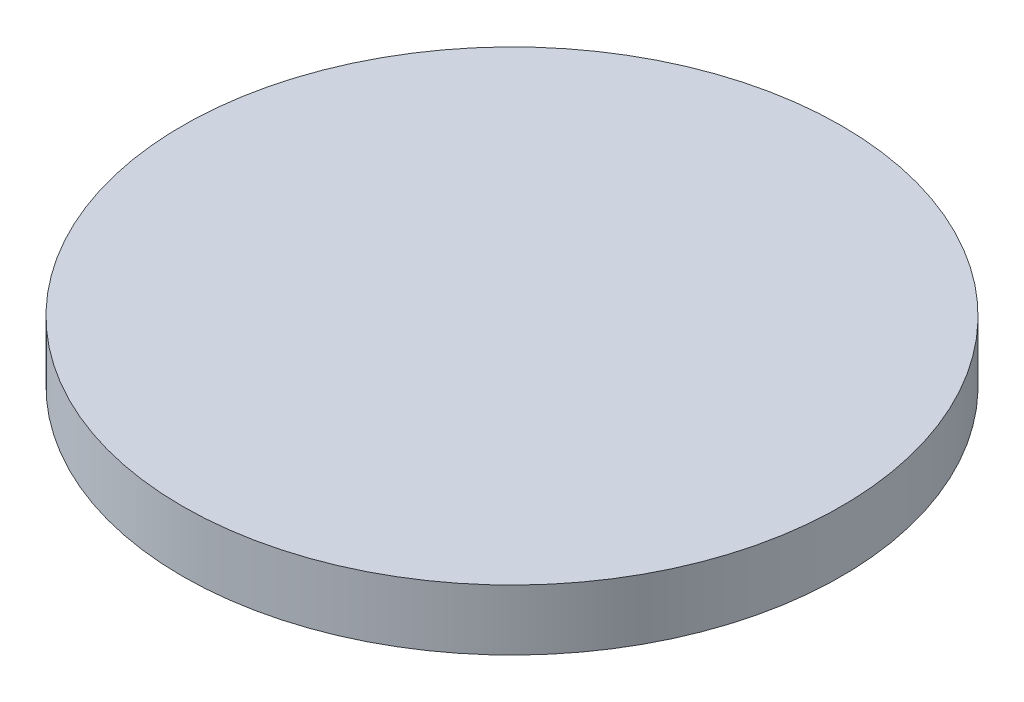
ISO-10303-21;
HEADER;
FILE_DESCRIPTION(('STEP AP214'),'2;1');
FILE_NAME('part.step','',(''),(''),'','','');
FILE_SCHEMA(('AUTOMOTIVE_DESIGN { 1 0 10303 214 1 1 1 1 }'));
ENDSEC;
DATA;
#1=APPLICATION_CONTEXT('core data for automotive mechanical design processes');
#2=APPLICATION_PROTOCOL_DEFINITION('international standard','automotive_design',2000,#1);
#3=PRODUCT_CONTEXT('',#1,'mechanical');
#4=PRODUCT('Part','Part','',(#3));
#5=PRODUCT_RELATED_PRODUCT_CATEGORY('part','',(#4));
#6=PRODUCT_DEFINITION_FORMATION('','',#4);
#7=PRODUCT_DEFINITION_CONTEXT('part definition',#1,'design');
#8=PRODUCT_DEFINITION('design','',#6,#7);
#9=PRODUCT_DEFINITION_SHAPE('','',#8);
#10=(LENGTH_UNIT() NAMED_UNIT(*) SI_UNIT(.MILLI.,.METRE.));
#11=(NAMED_UNIT(*) PLANE_ANGLE_UNIT() SI_UNIT($,.RADIAN.));
#12=(NAMED_UNIT(*) SI_UNIT($,.STERADIAN.) SOLID_ANGLE_UNIT());
#13=UNCERTAINTY_MEASURE_WITH_UNIT(LENGTH_MEASURE(1.E-05),#10,'distance_accuracy_value','');
#14=(GEOMETRIC_REPRESENTATION_CONTEXT(3) GLOBAL_UNCERTAINTY_ASSIGNED_CONTEXT((#13)) GLOBAL_UNIT_ASSIGNED_CONTEXT((#10,
#11,#12)) REPRESENTATION_CONTEXT('',''));
#15=CARTESIAN_POINT('',(0.,0.,0.));
#16=DIRECTION('',(0.,0.,1.));
#17=DIRECTION('',(1.,0.,0.));
#18=AXIS2_PLACEMENT_3D('',#15,#16,#17);
#19=CARTESIAN_POINT('',(0.,2.3,0.));
#20=DIRECTION('',(0.,-1.,0.));
#21=DIRECTION('',(0.,0.,-1.));
#22=AXIS2_PLACEMENT_3D('',#19,#20,#21);
#23=CYLINDRICAL_SURFACE('',#22,12.5);
#24=CARTESIAN_POINT('',(0.,2.3,0.));
#25=DIRECTION('',(0.,1.,0.));
#26=DIRECTION('',(0.,0.,1.));
#27=AXIS2_PLACEMENT_3D('',#24,#25,#26);
#28=CIRCLE('',#27,12.5);
#29=CARTESIAN_POINT('',(0.,2.3,12.5));
#30=VERTEX_POINT('',#29);
#31=EDGE_CURVE('E10',#30,#30,#28,.T.);
#32=ORIENTED_EDGE('',*,*,#31,.F.);
#33=EDGE_LOOP('',(#32));
#34=FACE_BOUND('',#33,.T.);
#35=CARTESIAN_POINT('',(0.,0.,0.));
#36=DIRECTION('',(0.,1.,0.));
#37=DIRECTION('',(0.,0.,1.));
#38=AXIS2_PLACEMENT_3D('',#35,#36,#37);
#39=CIRCLE('',#38,12.5);
#40=CARTESIAN_POINT('',(0.,0.,12.5));
#41=VERTEX_POINT('',#40);
#42=EDGE_CURVE('E36',#41,#41,#39,.T.);
#43=ORIENTED_EDGE('',*,*,#42,.T.);
#44=EDGE_LOOP('',(#43));
#45=FACE_BOUND('',#44,.T.);
#46=ADVANCED_FACE('F33',(#34,#45),#23,.T.);
#47=CARTESIAN_POINT('',(0.,2.3,0.));
#48=DIRECTION('',(0.,1.,0.));
#49=DIRECTION('',(0.,0.,1.));
#50=AXIS2_PLACEMENT_3D('',#47,#48,#49);
#51=PLANE('',#50);
#52=ORIENTED_EDGE('',*,*,#31,.T.);
#53=EDGE_LOOP('',(#52));
#54=FACE_BOUND('',#53,.T.);
#55=ADVANCED_FACE('F48',(#54),#51,.T.);
#56=CARTESIAN_POINT('',(0.,0.,0.));
#57=DIRECTION('',(0.,1.,0.));
#58=DIRECTION('',(0.,0.,1.));
#59=AXIS2_PLACEMENT_3D('',#56,#57,#58);
#60=PLANE('',#59);
#61=ORIENTED_EDGE('',*,*,#42,.F.);
#62=EDGE_LOOP('',(#61));
#63=FACE_BOUND('',#62,.T.);
#64=ADVANCED_FACE('F46',(#63),#60,.F.);
#65=CLOSED_SHELL('',(#46,#55,#64));
#66=MANIFOLD_SOLID_BREP('B2',#65);
#67=ADVANCED_BREP_SHAPE_REPRESENTATION('',(#18,#66),#14);
#68=SHAPE_DEFINITION_REPRESENTATION(#9,#67);
ENDSEC;
END-ISO-10303-21;
